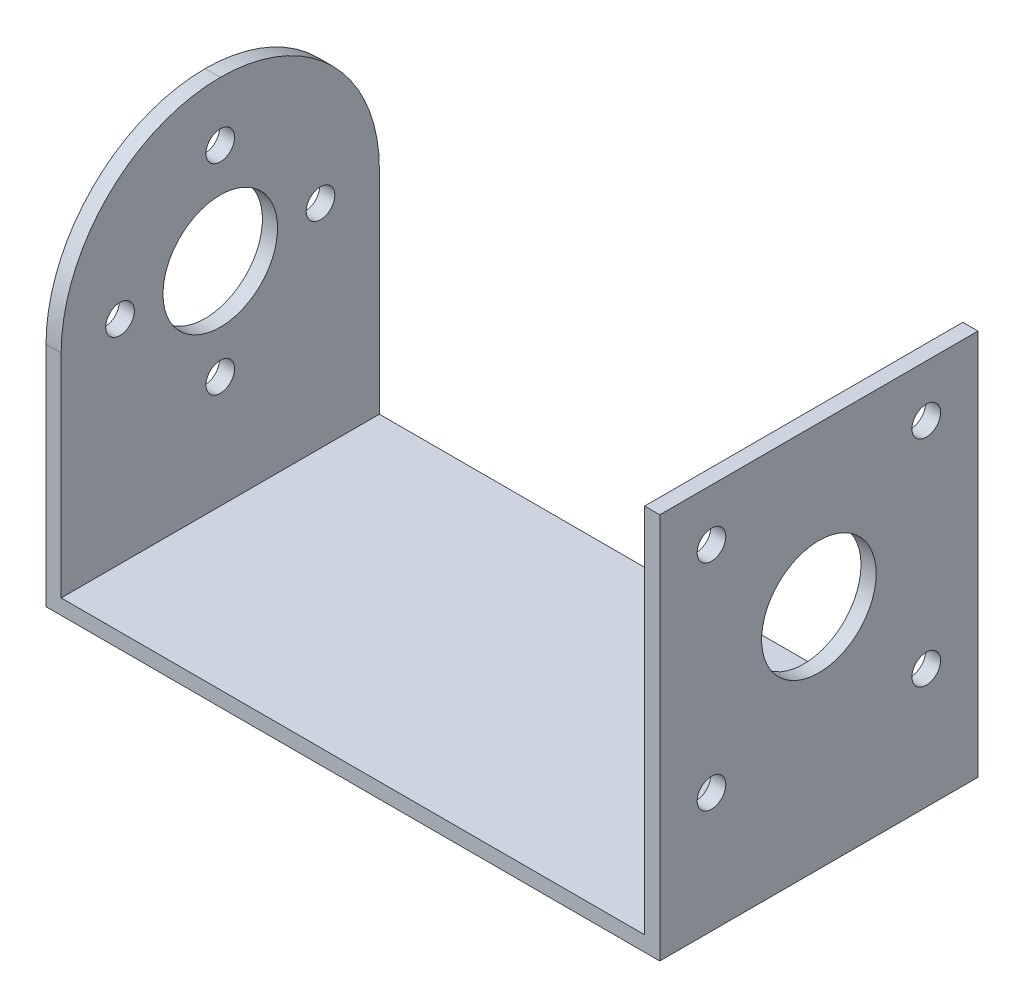
ISO-10303-21;
HEADER;
FILE_DESCRIPTION(('STEP AP214'),'2;1');
FILE_NAME('part.step','',(''),(''),'','','');
FILE_SCHEMA(('AUTOMOTIVE_DESIGN { 1 0 10303 214 1 1 1 1 }'));
ENDSEC;
DATA;
#1=APPLICATION_CONTEXT('core data for automotive mechanical design processes');
#2=APPLICATION_PROTOCOL_DEFINITION('international standard','automotive_design',2000,#1);
#3=PRODUCT_CONTEXT('',#1,'mechanical');
#4=PRODUCT('Part','Part','',(#3));
#5=PRODUCT_RELATED_PRODUCT_CATEGORY('part','',(#4));
#6=PRODUCT_DEFINITION_FORMATION('','',#4);
#7=PRODUCT_DEFINITION_CONTEXT('part definition',#1,'design');
#8=PRODUCT_DEFINITION('design','',#6,#7);
#9=PRODUCT_DEFINITION_SHAPE('','',#8);
#10=(LENGTH_UNIT() NAMED_UNIT(*) SI_UNIT(.MILLI.,.METRE.));
#11=(NAMED_UNIT(*) PLANE_ANGLE_UNIT() SI_UNIT($,.RADIAN.));
#12=(NAMED_UNIT(*) SI_UNIT($,.STERADIAN.) SOLID_ANGLE_UNIT());
#13=UNCERTAINTY_MEASURE_WITH_UNIT(LENGTH_MEASURE(1.E-05),#10,'distance_accuracy_value','');
#14=(GEOMETRIC_REPRESENTATION_CONTEXT(3) GLOBAL_UNCERTAINTY_ASSIGNED_CONTEXT((#13)) GLOBAL_UNIT_ASSIGNED_CONTEXT((#10,
#11,#12)) REPRESENTATION_CONTEXT('',''));
#15=CARTESIAN_POINT('',(0.,0.,0.));
#16=DIRECTION('',(0.,0.,1.));
#17=DIRECTION('',(1.,0.,0.));
#18=AXIS2_PLACEMENT_3D('',#15,#16,#17);
#19=CARTESIAN_POINT('',(0.,26.9875,22.225));
#20=DIRECTION('',(1.,0.,0.));
#21=DIRECTION('',(0.,0.,-1.));
#22=AXIS2_PLACEMENT_3D('',#19,#20,#21);
#23=PLANE('',#22);
#24=CARTESIAN_POINT('',(0.,15.8750000000001,18.1125));
#25=DIRECTION('',(-1.,0.,0.));
#26=DIRECTION('',(0.,-1.,0.));
#27=AXIS2_PLACEMENT_3D('',#24,#25,#26);
#28=CIRCLE('',#27,1.);
#29=CARTESIAN_POINT('',(0.,14.8750000000001,18.1125));
#30=VERTEX_POINT('',#29);
#31=EDGE_CURVE('E323',#30,#30,#28,.T.);
#32=ORIENTED_EDGE('',*,*,#31,.F.);
#33=EDGE_LOOP('',(#32));
#34=FACE_BOUND('',#33,.T.);
#35=CARTESIAN_POINT('',(0.,15.875,4.1125));
#36=DIRECTION('',(-1.,0.,0.));
#37=DIRECTION('',(0.,1.,0.));
#38=AXIS2_PLACEMENT_3D('',#35,#36,#37);
#39=CIRCLE('',#38,1.);
#40=CARTESIAN_POINT('',(0.,15.875,5.1125));
#41=VERTEX_POINT('',#40);
#42=EDGE_CURVE('E331',#41,#41,#39,.T.);
#43=ORIENTED_EDGE('',*,*,#42,.F.);
#44=EDGE_LOOP('',(#43));
#45=FACE_BOUND('',#44,.T.);
#46=CARTESIAN_POINT('',(0.,8.875,11.1125));
#47=DIRECTION('',(-1.,0.,0.));
#48=DIRECTION('',(0.,0.,-1.));
#49=AXIS2_PLACEMENT_3D('',#46,#47,#48);
#50=CIRCLE('',#49,1.);
#51=CARTESIAN_POINT('',(0.,8.875,10.1125));
#52=VERTEX_POINT('',#51);
#53=EDGE_CURVE('E324',#52,#52,#50,.T.);
#54=ORIENTED_EDGE('',*,*,#53,.F.);
#55=EDGE_LOOP('',(#54));
#56=FACE_BOUND('',#55,.T.);
#57=CARTESIAN_POINT('',(0.,15.875,11.1125));
#58=DIRECTION('',(-1.,0.,0.));
#59=DIRECTION('',(0.,0.,1.));
#60=AXIS2_PLACEMENT_3D('',#57,#58,#59);
#61=CIRCLE('',#60,4.);
#62=CARTESIAN_POINT('',(0.,15.875,15.1125));
#63=VERTEX_POINT('',#62);
#64=EDGE_CURVE('E200',#63,#63,#61,.T.);
#65=ORIENTED_EDGE('',*,*,#64,.F.);
#66=EDGE_LOOP('',(#65));
#67=FACE_BOUND('',#66,.T.);
#68=CARTESIAN_POINT('',(0.,22.875,11.1125));
#69=DIRECTION('',(-1.,0.,0.));
#70=DIRECTION('',(0.,0.,1.));
#71=AXIS2_PLACEMENT_3D('',#68,#69,#70);
#72=CIRCLE('',#71,1.);
#73=CARTESIAN_POINT('',(0.,22.875,12.1125));
#74=VERTEX_POINT('',#73);
#75=EDGE_CURVE('E209',#74,#74,#72,.T.);
#76=ORIENTED_EDGE('',*,*,#75,.F.);
#77=EDGE_LOOP('',(#76));
#78=FACE_BOUND('',#77,.T.);
#79=CARTESIAN_POINT('',(0.,15.875,11.1125));
#80=DIRECTION('',(1.,0.,0.));
#81=DIRECTION('',(0.,0.,-1.));
#82=AXIS2_PLACEMENT_3D('',#79,#80,#81);
#83=CIRCLE('',#82,11.1125);
#84=CARTESIAN_POINT('',(0.,15.875,22.225));
#85=VERTEX_POINT('',#84);
#86=CARTESIAN_POINT('',(0.,26.9875,11.1125));
#87=VERTEX_POINT('',#86);
#88=EDGE_CURVE('E117',#85,#87,#83,.F.);
#89=ORIENTED_EDGE('',*,*,#88,.T.);
#90=CARTESIAN_POINT('',(0.,15.875,11.1125));
#91=DIRECTION('',(1.,0.,0.));
#92=DIRECTION('',(0.,0.,-1.));
#93=AXIS2_PLACEMENT_3D('',#90,#91,#92);
#94=CIRCLE('',#93,11.1125);
#95=CARTESIAN_POINT('',(0.,15.875,0.));
#96=VERTEX_POINT('',#95);
#97=EDGE_CURVE('E162',#87,#96,#94,.F.);
#98=ORIENTED_EDGE('',*,*,#97,.T.);
#99=DIRECTION('',(0.,-1.,0.));
#100=VECTOR('',#99,1.);
#101=CARTESIAN_POINT('',(0.,26.9875,0.));
#102=LINE('',#101,#100);
#103=CARTESIAN_POINT('',(0.,0.,0.));
#104=VERTEX_POINT('',#103);
#105=EDGE_CURVE('E114',#96,#104,#102,.T.);
#106=ORIENTED_EDGE('',*,*,#105,.T.);
#107=DIRECTION('',(0.,0.,-1.));
#108=VECTOR('',#107,1.);
#109=CARTESIAN_POINT('',(0.,0.,22.225));
#110=LINE('',#109,#108);
#111=CARTESIAN_POINT('',(0.,0.,22.225));
#112=VERTEX_POINT('',#111);
#113=EDGE_CURVE('E112',#112,#104,#110,.T.);
#114=ORIENTED_EDGE('',*,*,#113,.F.);
#115=DIRECTION('',(0.,-1.,0.));
#116=VECTOR('',#115,1.);
#117=CARTESIAN_POINT('',(0.,26.9875,22.225));
#118=LINE('',#117,#116);
#119=EDGE_CURVE('E100',#85,#112,#118,.T.);
#120=ORIENTED_EDGE('',*,*,#119,.F.);
#121=EDGE_LOOP('',(#89,#98,#106,#114,#120));
#122=FACE_BOUND('',#121,.T.);
#123=ADVANCED_FACE('F32',(#34,#45,#56,#67,#78,#122),#23,.F.);
#124=CARTESIAN_POINT('',(0.,0.,22.225));
#125=DIRECTION('',(0.,1.,0.));
#126=DIRECTION('',(0.,0.,1.));
#127=AXIS2_PLACEMENT_3D('',#124,#125,#126);
#128=PLANE('',#127);
#129=DIRECTION('',(1.,0.,0.));
#130=VECTOR('',#129,1.);
#131=CARTESIAN_POINT('',(0.,0.,0.));
#132=LINE('',#131,#130);
#133=CARTESIAN_POINT('',(42.8625,0.,0.));
#134=VERTEX_POINT('',#133);
#135=EDGE_CURVE('E138',#104,#134,#132,.T.);
#136=ORIENTED_EDGE('',*,*,#135,.T.);
#137=DIRECTION('',(0.,0.,-1.));
#138=VECTOR('',#137,1.);
#139=CARTESIAN_POINT('',(42.8625,0.,22.225));
#140=LINE('',#139,#138);
#141=CARTESIAN_POINT('',(42.8625,0.,22.225));
#142=VERTEX_POINT('',#141);
#143=EDGE_CURVE('E118',#142,#134,#140,.T.);
#144=ORIENTED_EDGE('',*,*,#143,.F.);
#145=DIRECTION('',(1.,0.,0.));
#146=VECTOR('',#145,1.);
#147=CARTESIAN_POINT('',(0.,0.,22.225));
#148=LINE('',#147,#146);
#149=EDGE_CURVE('E104',#112,#142,#148,.T.);
#150=ORIENTED_EDGE('',*,*,#149,.F.);
#151=ORIENTED_EDGE('',*,*,#113,.T.);
#152=EDGE_LOOP('',(#136,#144,#150,#151));
#153=FACE_BOUND('',#152,.T.);
#154=ADVANCED_FACE('F120',(#153),#128,.F.);
#155=CARTESIAN_POINT('',(42.8625,0.,22.225));
#156=DIRECTION('',(-1.,0.,0.));
#157=DIRECTION('',(0.,0.,1.));
#158=AXIS2_PLACEMENT_3D('',#155,#156,#157);
#159=PLANE('',#158);
#160=CARTESIAN_POINT('',(42.8625,23.3749999999999,18.6125));
#161=DIRECTION('',(1.,0.,0.));
#162=DIRECTION('',(0.,0.,-1.));
#163=AXIS2_PLACEMENT_3D('',#160,#161,#162);
#164=CIRCLE('',#163,1.);
#165=CARTESIAN_POINT('',(42.8625,23.3749999999999,17.6125));
#166=VERTEX_POINT('',#165);
#167=EDGE_CURVE('E306',#166,#166,#164,.T.);
#168=ORIENTED_EDGE('',*,*,#167,.F.);
#169=EDGE_LOOP('',(#168));
#170=FACE_BOUND('',#169,.T.);
#171=CARTESIAN_POINT('',(42.8625,8.37500000000008,3.6125));
#172=DIRECTION('',(1.,0.,0.));
#173=DIRECTION('',(0.,0.,-1.));
#174=AXIS2_PLACEMENT_3D('',#171,#172,#173);
#175=CIRCLE('',#174,1.);
#176=CARTESIAN_POINT('',(42.8625,8.37500000000008,2.6125));
#177=VERTEX_POINT('',#176);
#178=EDGE_CURVE('E298',#177,#177,#175,.T.);
#179=ORIENTED_EDGE('',*,*,#178,.F.);
#180=EDGE_LOOP('',(#179));
#181=FACE_BOUND('',#180,.T.);
#182=CARTESIAN_POINT('',(42.8625,8.37500000000008,18.6125));
#183=DIRECTION('',(1.,0.,0.));
#184=DIRECTION('',(0.,0.,-1.));
#185=AXIS2_PLACEMENT_3D('',#182,#183,#184);
#186=CIRCLE('',#185,1.);
#187=CARTESIAN_POINT('',(42.8625,8.37500000000008,17.6125));
#188=VERTEX_POINT('',#187);
#189=EDGE_CURVE('E294',#188,#188,#186,.T.);
#190=ORIENTED_EDGE('',*,*,#189,.F.);
#191=EDGE_LOOP('',(#190));
#192=FACE_BOUND('',#191,.T.);
#193=CARTESIAN_POINT('',(42.8625,15.875,11.1125));
#194=DIRECTION('',(1.,0.,0.));
#195=DIRECTION('',(0.,0.,-1.));
#196=AXIS2_PLACEMENT_3D('',#193,#194,#195);
#197=CIRCLE('',#196,4.);
#198=CARTESIAN_POINT('',(42.8625,15.875,7.1125));
#199=VERTEX_POINT('',#198);
#200=EDGE_CURVE('E301',#199,#199,#197,.T.);
#201=ORIENTED_EDGE('',*,*,#200,.F.);
#202=EDGE_LOOP('',(#201));
#203=FACE_BOUND('',#202,.T.);
#204=CARTESIAN_POINT('',(42.8625,23.3749999999999,3.6125));
#205=DIRECTION('',(1.,0.,0.));
#206=DIRECTION('',(0.,0.,-1.));
#207=AXIS2_PLACEMENT_3D('',#204,#205,#206);
#208=CIRCLE('',#207,1.);
#209=CARTESIAN_POINT('',(42.8625,23.3749999999999,2.6125));
#210=VERTEX_POINT('',#209);
#211=EDGE_CURVE('E313',#210,#210,#208,.T.);
#212=ORIENTED_EDGE('',*,*,#211,.F.);
#213=EDGE_LOOP('',(#212));
#214=FACE_BOUND('',#213,.T.);
#215=DIRECTION('',(0.,1.,0.));
#216=VECTOR('',#215,1.);
#217=CARTESIAN_POINT('',(42.8625,0.,0.));
#218=LINE('',#217,#216);
#219=CARTESIAN_POINT('',(42.8625,26.9875,0.));
#220=VERTEX_POINT('',#219);
#221=EDGE_CURVE('E140',#134,#220,#218,.T.);
#222=ORIENTED_EDGE('',*,*,#221,.T.);
#223=DIRECTION('',(0.,0.,-1.));
#224=VECTOR('',#223,1.);
#225=CARTESIAN_POINT('',(42.8625,26.9875,22.225));
#226=LINE('',#225,#224);
#227=CARTESIAN_POINT('',(42.8625,26.9875,22.225));
#228=VERTEX_POINT('',#227);
#229=EDGE_CURVE('E157',#228,#220,#226,.T.);
#230=ORIENTED_EDGE('',*,*,#229,.F.);
#231=DIRECTION('',(0.,1.,0.));
#232=VECTOR('',#231,1.);
#233=CARTESIAN_POINT('',(42.8625,0.,22.225));
#234=LINE('',#233,#232);
#235=EDGE_CURVE('E123',#142,#228,#234,.T.);
#236=ORIENTED_EDGE('',*,*,#235,.F.);
#237=ORIENTED_EDGE('',*,*,#143,.T.);
#238=EDGE_LOOP('',(#222,#230,#236,#237));
#239=FACE_BOUND('',#238,.T.);
#240=ADVANCED_FACE('F193',(#170,#181,#192,#203,#214,#239),#159,.F.);
#241=CARTESIAN_POINT('',(42.8625,26.9875,22.225));
#242=DIRECTION('',(0.,-1.,0.));
#243=DIRECTION('',(0.,0.,-1.));
#244=AXIS2_PLACEMENT_3D('',#241,#242,#243);
#245=PLANE('',#244);
#246=DIRECTION('',(-1.,0.,0.));
#247=VECTOR('',#246,1.);
#248=CARTESIAN_POINT('',(42.8625,26.9875,0.));
#249=LINE('',#248,#247);
#250=CARTESIAN_POINT('',(41.8041666666667,26.9875,0.));
#251=VERTEX_POINT('',#250);
#252=EDGE_CURVE('E142',#220,#251,#249,.T.);
#253=ORIENTED_EDGE('',*,*,#252,.T.);
#254=DIRECTION('',(0.,0.,-1.));
#255=VECTOR('',#254,1.);
#256=CARTESIAN_POINT('',(41.8041666666667,26.9875,22.225));
#257=LINE('',#256,#255);
#258=CARTESIAN_POINT('',(41.8041666666667,26.9875,22.225));
#259=VERTEX_POINT('',#258);
#260=EDGE_CURVE('E154',#259,#251,#257,.T.);
#261=ORIENTED_EDGE('',*,*,#260,.F.);
#262=DIRECTION('',(-1.,0.,0.));
#263=VECTOR('',#262,1.);
#264=CARTESIAN_POINT('',(42.8625,26.9875,22.225));
#265=LINE('',#264,#263);
#266=EDGE_CURVE('E125',#228,#259,#265,.T.);
#267=ORIENTED_EDGE('',*,*,#266,.F.);
#268=ORIENTED_EDGE('',*,*,#229,.T.);
#269=EDGE_LOOP('',(#253,#261,#267,#268));
#270=FACE_BOUND('',#269,.T.);
#271=ADVANCED_FACE('F190',(#270),#245,.F.);
#272=CARTESIAN_POINT('',(41.8041666666667,26.9875,22.225));
#273=DIRECTION('',(1.,0.,0.));
#274=DIRECTION('',(0.,1.,0.));
#275=AXIS2_PLACEMENT_3D('',#272,#273,#274);
#276=PLANE('',#275);
#277=CARTESIAN_POINT('',(41.8041666666667,23.3749999999999,18.6125));
#278=DIRECTION('',(1.,0.,0.));
#279=DIRECTION('',(0.,1.,0.));
#280=AXIS2_PLACEMENT_3D('',#277,#278,#279);
#281=CIRCLE('',#280,1.);
#282=CARTESIAN_POINT('',(41.8041666666667,24.3749999999999,18.6125));
#283=VERTEX_POINT('',#282);
#284=EDGE_CURVE('E309',#283,#283,#281,.F.);
#285=ORIENTED_EDGE('',*,*,#284,.F.);
#286=EDGE_LOOP('',(#285));
#287=FACE_BOUND('',#286,.T.);
#288=CARTESIAN_POINT('',(41.8041666666667,8.37500000000008,3.6125));
#289=DIRECTION('',(1.,0.,0.));
#290=DIRECTION('',(0.,1.,0.));
#291=AXIS2_PLACEMENT_3D('',#288,#289,#290);
#292=CIRCLE('',#291,1.);
#293=CARTESIAN_POINT('',(41.8041666666667,9.37500000000008,3.6125));
#294=VERTEX_POINT('',#293);
#295=EDGE_CURVE('E310',#294,#294,#292,.F.);
#296=ORIENTED_EDGE('',*,*,#295,.F.);
#297=EDGE_LOOP('',(#296));
#298=FACE_BOUND('',#297,.T.);
#299=CARTESIAN_POINT('',(41.8041666666667,8.37500000000008,18.6125));
#300=DIRECTION('',(1.,0.,0.));
#301=DIRECTION('',(0.,1.,0.));
#302=AXIS2_PLACEMENT_3D('',#299,#300,#301);
#303=CIRCLE('',#302,1.);
#304=CARTESIAN_POINT('',(41.8041666666667,9.37500000000009,18.6125));
#305=VERTEX_POINT('',#304);
#306=EDGE_CURVE('E291',#305,#305,#303,.F.);
#307=ORIENTED_EDGE('',*,*,#306,.F.);
#308=EDGE_LOOP('',(#307));
#309=FACE_BOUND('',#308,.T.);
#310=CARTESIAN_POINT('',(41.8041666666667,15.875,11.1125));
#311=DIRECTION('',(1.,0.,0.));
#312=DIRECTION('',(0.,1.,0.));
#313=AXIS2_PLACEMENT_3D('',#310,#311,#312);
#314=CIRCLE('',#313,4.);
#315=CARTESIAN_POINT('',(41.8041666666667,19.875,11.1125));
#316=VERTEX_POINT('',#315);
#317=EDGE_CURVE('E296',#316,#316,#314,.F.);
#318=ORIENTED_EDGE('',*,*,#317,.F.);
#319=EDGE_LOOP('',(#318));
#320=FACE_BOUND('',#319,.T.);
#321=CARTESIAN_POINT('',(41.8041666666667,23.3749999999999,3.6125));
#322=DIRECTION('',(1.,0.,0.));
#323=DIRECTION('',(0.,1.,0.));
#324=AXIS2_PLACEMENT_3D('',#321,#322,#323);
#325=CIRCLE('',#324,1.);
#326=CARTESIAN_POINT('',(41.8041666666667,24.3749999999999,3.6125));
#327=VERTEX_POINT('',#326);
#328=EDGE_CURVE('E320',#327,#327,#325,.F.);
#329=ORIENTED_EDGE('',*,*,#328,.F.);
#330=EDGE_LOOP('',(#329));
#331=FACE_BOUND('',#330,.T.);
#332=DIRECTION('',(0.,-1.,0.));
#333=VECTOR('',#332,1.);
#334=CARTESIAN_POINT('',(41.8041666666667,26.9875,0.));
#335=LINE('',#334,#333);
#336=CARTESIAN_POINT('',(41.8041666666667,1.05833333333333,0.));
#337=VERTEX_POINT('',#336);
#338=EDGE_CURVE('E144',#251,#337,#335,.T.);
#339=ORIENTED_EDGE('',*,*,#338,.T.);
#340=DIRECTION('',(0.,0.,-1.));
#341=VECTOR('',#340,1.);
#342=CARTESIAN_POINT('',(41.8041666666667,1.05833333333333,22.225));
#343=LINE('',#342,#341);
#344=CARTESIAN_POINT('',(41.8041666666667,1.05833333333333,22.225));
#345=VERTEX_POINT('',#344);
#346=EDGE_CURVE('E151',#345,#337,#343,.T.);
#347=ORIENTED_EDGE('',*,*,#346,.F.);
#348=DIRECTION('',(0.,-1.,0.));
#349=VECTOR('',#348,1.);
#350=CARTESIAN_POINT('',(41.8041666666667,26.9875,22.225));
#351=LINE('',#350,#349);
#352=EDGE_CURVE('E130',#259,#345,#351,.T.);
#353=ORIENTED_EDGE('',*,*,#352,.F.);
#354=ORIENTED_EDGE('',*,*,#260,.T.);
#355=EDGE_LOOP('',(#339,#347,#353,#354));
#356=FACE_BOUND('',#355,.T.);
#357=ADVANCED_FACE('F185',(#287,#298,#309,#320,#331,#356),#276,.F.);
#358=CARTESIAN_POINT('',(41.8041666666667,1.05833333333333,22.225));
#359=DIRECTION('',(0.,-1.,0.));
#360=DIRECTION('',(1.,0.,0.));
#361=AXIS2_PLACEMENT_3D('',#358,#359,#360);
#362=PLANE('',#361);
#363=DIRECTION('',(-1.,0.,0.));
#364=VECTOR('',#363,1.);
#365=CARTESIAN_POINT('',(41.8041666666667,1.05833333333333,0.));
#366=LINE('',#365,#364);
#367=CARTESIAN_POINT('',(1.05833333333333,1.05833333333333,0.));
#368=VERTEX_POINT('',#367);
#369=EDGE_CURVE('E146',#337,#368,#366,.T.);
#370=ORIENTED_EDGE('',*,*,#369,.T.);
#371=DIRECTION('',(0.,0.,-1.));
#372=VECTOR('',#371,1.);
#373=CARTESIAN_POINT('',(1.05833333333333,1.05833333333333,22.225));
#374=LINE('',#373,#372);
#375=CARTESIAN_POINT('',(1.05833333333333,1.05833333333333,22.225));
#376=VERTEX_POINT('',#375);
#377=EDGE_CURVE('E136',#376,#368,#374,.T.);
#378=ORIENTED_EDGE('',*,*,#377,.F.);
#379=DIRECTION('',(-1.,0.,0.));
#380=VECTOR('',#379,1.);
#381=CARTESIAN_POINT('',(41.8041666666667,1.05833333333333,22.225));
#382=LINE('',#381,#380);
#383=EDGE_CURVE('E132',#345,#376,#382,.T.);
#384=ORIENTED_EDGE('',*,*,#383,.F.);
#385=ORIENTED_EDGE('',*,*,#346,.T.);
#386=EDGE_LOOP('',(#370,#378,#384,#385));
#387=FACE_BOUND('',#386,.T.);
#388=ADVANCED_FACE('F179',(#387),#362,.F.);
#389=CARTESIAN_POINT('',(1.05833333333333,1.05833333333333,22.225));
#390=DIRECTION('',(-1.,0.,0.));
#391=DIRECTION('',(0.,0.,1.));
#392=AXIS2_PLACEMENT_3D('',#389,#390,#391);
#393=PLANE('',#392);
#394=CARTESIAN_POINT('',(1.05833333333333,15.8750000000001,18.1125));
#395=DIRECTION('',(-1.,0.,0.));
#396=DIRECTION('',(0.,0.,1.));
#397=AXIS2_PLACEMENT_3D('',#394,#395,#396);
#398=CIRCLE('',#397,1.);
#399=CARTESIAN_POINT('',(1.05833333333333,15.8750000000001,19.1125));
#400=VERTEX_POINT('',#399);
#401=EDGE_CURVE('E328',#400,#400,#398,.F.);
#402=ORIENTED_EDGE('',*,*,#401,.F.);
#403=EDGE_LOOP('',(#402));
#404=FACE_BOUND('',#403,.T.);
#405=CARTESIAN_POINT('',(1.05833333333333,15.875,4.1125));
#406=DIRECTION('',(-1.,0.,0.));
#407=DIRECTION('',(0.,0.,1.));
#408=AXIS2_PLACEMENT_3D('',#405,#406,#407);
#409=CIRCLE('',#408,1.);
#410=CARTESIAN_POINT('',(1.05833333333333,15.875,5.1125));
#411=VERTEX_POINT('',#410);
#412=EDGE_CURVE('E211',#411,#411,#409,.F.);
#413=ORIENTED_EDGE('',*,*,#412,.F.);
#414=EDGE_LOOP('',(#413));
#415=FACE_BOUND('',#414,.T.);
#416=CARTESIAN_POINT('',(1.05833333333333,8.875,11.1125));
#417=DIRECTION('',(-1.,0.,0.));
#418=DIRECTION('',(0.,0.,1.));
#419=AXIS2_PLACEMENT_3D('',#416,#417,#418);
#420=CIRCLE('',#419,1.);
#421=CARTESIAN_POINT('',(1.05833333333333,8.875,12.1125));
#422=VERTEX_POINT('',#421);
#423=EDGE_CURVE('E327',#422,#422,#420,.F.);
#424=ORIENTED_EDGE('',*,*,#423,.F.);
#425=EDGE_LOOP('',(#424));
#426=FACE_BOUND('',#425,.T.);
#427=CARTESIAN_POINT('',(1.05833333333333,15.875,11.1125));
#428=DIRECTION('',(-1.,0.,0.));
#429=DIRECTION('',(0.,0.,1.));
#430=AXIS2_PLACEMENT_3D('',#427,#428,#429);
#431=CIRCLE('',#430,4.);
#432=CARTESIAN_POINT('',(1.05833333333333,15.875,15.1125));
#433=VERTEX_POINT('',#432);
#434=EDGE_CURVE('E198',#433,#433,#431,.F.);
#435=ORIENTED_EDGE('',*,*,#434,.F.);
#436=EDGE_LOOP('',(#435));
#437=FACE_BOUND('',#436,.T.);
#438=CARTESIAN_POINT('',(1.05833333333333,22.875,11.1125));
#439=DIRECTION('',(-1.,0.,0.));
#440=DIRECTION('',(0.,0.,1.));
#441=AXIS2_PLACEMENT_3D('',#438,#439,#440);
#442=CIRCLE('',#441,1.);
#443=CARTESIAN_POINT('',(1.05833333333333,22.875,12.1125));
#444=VERTEX_POINT('',#443);
#445=EDGE_CURVE('E205',#444,#444,#442,.F.);
#446=ORIENTED_EDGE('',*,*,#445,.F.);
#447=EDGE_LOOP('',(#446));
#448=FACE_BOUND('',#447,.T.);
#449=DIRECTION('',(0.,1.,0.));
#450=VECTOR('',#449,1.);
#451=CARTESIAN_POINT('',(1.05833333333333,1.05833333333333,0.));
#452=LINE('',#451,#450);
#453=CARTESIAN_POINT('',(1.05833333333333,15.875,0.));
#454=VERTEX_POINT('',#453);
#455=EDGE_CURVE('E109',#368,#454,#452,.T.);
#456=ORIENTED_EDGE('',*,*,#455,.T.);
#457=CARTESIAN_POINT('',(1.05833333333333,15.875,11.1125));
#458=DIRECTION('',(-1.,0.,0.));
#459=DIRECTION('',(0.,0.,1.));
#460=AXIS2_PLACEMENT_3D('',#457,#458,#459);
#461=CIRCLE('',#460,11.1125);
#462=CARTESIAN_POINT('',(1.05833333333333,26.9875,11.1125));
#463=VERTEX_POINT('',#462);
#464=EDGE_CURVE('E41',#454,#463,#461,.F.);
#465=ORIENTED_EDGE('',*,*,#464,.T.);
#466=CARTESIAN_POINT('',(1.05833333333333,15.875,11.1125));
#467=DIRECTION('',(-1.,0.,0.));
#468=DIRECTION('',(0.,0.,1.));
#469=AXIS2_PLACEMENT_3D('',#466,#467,#468);
#470=CIRCLE('',#469,11.1125);
#471=CARTESIAN_POINT('',(1.05833333333333,15.875,22.225));
#472=VERTEX_POINT('',#471);
#473=EDGE_CURVE('E48',#463,#472,#470,.F.);
#474=ORIENTED_EDGE('',*,*,#473,.T.);
#475=DIRECTION('',(0.,1.,0.));
#476=VECTOR('',#475,1.);
#477=CARTESIAN_POINT('',(1.05833333333333,1.05833333333333,22.225));
#478=LINE('',#477,#476);
#479=EDGE_CURVE('E134',#376,#472,#478,.T.);
#480=ORIENTED_EDGE('',*,*,#479,.F.);
#481=ORIENTED_EDGE('',*,*,#377,.T.);
#482=EDGE_LOOP('',(#456,#465,#474,#480,#481));
#483=FACE_BOUND('',#482,.T.);
#484=ADVANCED_FACE('F175',(#404,#415,#426,#437,#448,#483),#393,.F.);
#485=CARTESIAN_POINT('',(0.,0.,22.225));
#486=DIRECTION('',(0.,0.,1.));
#487=DIRECTION('',(1.,0.,0.));
#488=AXIS2_PLACEMENT_3D('',#485,#486,#487);
#489=PLANE('',#488);
#490=ORIENTED_EDGE('',*,*,#479,.T.);
#491=DIRECTION('',(-1.,0.,0.));
#492=VECTOR('',#491,1.);
#493=CARTESIAN_POINT('',(0.,15.875,22.225));
#494=LINE('',#493,#492);
#495=EDGE_CURVE('E11',#472,#85,#494,.T.);
#496=ORIENTED_EDGE('',*,*,#495,.T.);
#497=ORIENTED_EDGE('',*,*,#119,.T.);
#498=ORIENTED_EDGE('',*,*,#149,.T.);
#499=ORIENTED_EDGE('',*,*,#235,.T.);
#500=ORIENTED_EDGE('',*,*,#266,.T.);
#501=ORIENTED_EDGE('',*,*,#352,.T.);
#502=ORIENTED_EDGE('',*,*,#383,.T.);
#503=EDGE_LOOP('',(#490,#496,#497,#498,#499,#500,#501,#502));
#504=FACE_BOUND('',#503,.T.);
#505=ADVANCED_FACE('F102',(#504),#489,.T.);
#506=CARTESIAN_POINT('',(0.,0.,0.));
#507=DIRECTION('',(0.,0.,1.));
#508=DIRECTION('',(1.,0.,0.));
#509=AXIS2_PLACEMENT_3D('',#506,#507,#508);
#510=PLANE('',#509);
#511=ORIENTED_EDGE('',*,*,#105,.F.);
#512=DIRECTION('',(-1.,0.,0.));
#513=VECTOR('',#512,1.);
#514=CARTESIAN_POINT('',(0.,15.875,0.));
#515=LINE('',#514,#513);
#516=EDGE_CURVE('E164',#96,#454,#515,.F.);
#517=ORIENTED_EDGE('',*,*,#516,.T.);
#518=ORIENTED_EDGE('',*,*,#455,.F.);
#519=ORIENTED_EDGE('',*,*,#369,.F.);
#520=ORIENTED_EDGE('',*,*,#338,.F.);
#521=ORIENTED_EDGE('',*,*,#252,.F.);
#522=ORIENTED_EDGE('',*,*,#221,.F.);
#523=ORIENTED_EDGE('',*,*,#135,.F.);
#524=EDGE_LOOP('',(#511,#517,#518,#519,#520,#521,#522,#523));
#525=FACE_BOUND('',#524,.T.);
#526=ADVANCED_FACE('F171',(#525),#510,.F.);
#527=CARTESIAN_POINT('',(0.,15.875,11.1125));
#528=DIRECTION('',(1.,0.,0.));
#529=DIRECTION('',(0.,0.,-1.));
#530=AXIS2_PLACEMENT_3D('',#527,#528,#529);
#531=CYLINDRICAL_SURFACE('',#530,11.1125);
#532=ORIENTED_EDGE('',*,*,#495,.F.);
#533=ORIENTED_EDGE('',*,*,#473,.F.);
#534=DIRECTION('',(-1.,0.,0.));
#535=VECTOR('',#534,1.);
#536=CARTESIAN_POINT('',(1.05833333333333,26.9875,11.1125));
#537=LINE('',#536,#535);
#538=EDGE_CURVE('E36',#87,#463,#537,.F.);
#539=ORIENTED_EDGE('',*,*,#538,.F.);
#540=ORIENTED_EDGE('',*,*,#88,.F.);
#541=EDGE_LOOP('',(#532,#533,#539,#540));
#542=FACE_BOUND('',#541,.T.);
#543=ADVANCED_FACE('F34',(#542),#531,.T.);
#544=CARTESIAN_POINT('',(1.05833333333333,15.875,11.1125));
#545=DIRECTION('',(-1.,0.,0.));
#546=DIRECTION('',(0.,0.,1.));
#547=AXIS2_PLACEMENT_3D('',#544,#545,#546);
#548=CYLINDRICAL_SURFACE('',#547,11.1125);
#549=ORIENTED_EDGE('',*,*,#464,.F.);
#550=ORIENTED_EDGE('',*,*,#516,.F.);
#551=ORIENTED_EDGE('',*,*,#97,.F.);
#552=ORIENTED_EDGE('',*,*,#538,.T.);
#553=EDGE_LOOP('',(#549,#550,#551,#552));
#554=FACE_BOUND('',#553,.T.);
#555=ADVANCED_FACE('F197',(#554),#548,.T.);
#556=CARTESIAN_POINT('',(12.3720418323181,22.875,11.1125));
#557=DIRECTION('',(-1.,0.,0.));
#558=DIRECTION('',(0.,0.,1.));
#559=AXIS2_PLACEMENT_3D('',#556,#557,#558);
#560=CYLINDRICAL_SURFACE('',#559,1.);
#561=ORIENTED_EDGE('',*,*,#445,.T.);
#562=EDGE_LOOP('',(#561));
#563=FACE_BOUND('',#562,.T.);
#564=ORIENTED_EDGE('',*,*,#75,.T.);
#565=EDGE_LOOP('',(#564));
#566=FACE_BOUND('',#565,.T.);
#567=ADVANCED_FACE('F215',(#563,#566),#560,.F.);
#568=CARTESIAN_POINT('',(12.3720418323181,15.875,11.1125));
#569=DIRECTION('',(-1.,0.,0.));
#570=DIRECTION('',(0.,0.,1.));
#571=AXIS2_PLACEMENT_3D('',#568,#569,#570);
#572=CYLINDRICAL_SURFACE('',#571,4.);
#573=ORIENTED_EDGE('',*,*,#434,.T.);
#574=EDGE_LOOP('',(#573));
#575=FACE_BOUND('',#574,.T.);
#576=ORIENTED_EDGE('',*,*,#64,.T.);
#577=EDGE_LOOP('',(#576));
#578=FACE_BOUND('',#577,.T.);
#579=ADVANCED_FACE('F245',(#575,#578),#572,.F.);
#580=CARTESIAN_POINT('',(12.3720418323181,8.875,11.1125));
#581=DIRECTION('',(-1.,0.,0.));
#582=DIRECTION('',(0.,0.,1.));
#583=AXIS2_PLACEMENT_3D('',#580,#581,#582);
#584=CYLINDRICAL_SURFACE('',#583,1.);
#585=ORIENTED_EDGE('',*,*,#423,.T.);
#586=EDGE_LOOP('',(#585));
#587=FACE_BOUND('',#586,.T.);
#588=ORIENTED_EDGE('',*,*,#53,.T.);
#589=EDGE_LOOP('',(#588));
#590=FACE_BOUND('',#589,.T.);
#591=ADVANCED_FACE('F255',(#587,#590),#584,.F.);
#592=CARTESIAN_POINT('',(12.3720418323181,15.875,4.1125));
#593=DIRECTION('',(-1.,0.,0.));
#594=DIRECTION('',(0.,0.,1.));
#595=AXIS2_PLACEMENT_3D('',#592,#593,#594);
#596=CYLINDRICAL_SURFACE('',#595,1.);
#597=CARTESIAN_POINT('',(1.05833333333333,15.875,5.1125));
#598=CARTESIAN_POINT('',(1.04730902777778,15.875,5.1125));
#599=CARTESIAN_POINT('',(1.03628472222222,15.875,5.1125));
#600=CARTESIAN_POINT('',(1.01423611111111,15.875,5.1125));
#601=CARTESIAN_POINT('',(1.00321180555556,15.875,5.1125));
#602=CARTESIAN_POINT('',(0.981163194444444,15.875,5.1125));
#603=CARTESIAN_POINT('',(0.970138888888889,15.875,5.1125));
#604=CARTESIAN_POINT('',(0.948090277777778,15.875,5.1125));
#605=CARTESIAN_POINT('',(0.937065972222223,15.875,5.1125));
#606=CARTESIAN_POINT('',(0.915017361111112,15.875,5.1125));
#607=CARTESIAN_POINT('',(0.903993055555556,15.875,5.1125));
#608=CARTESIAN_POINT('',(0.881944444444445,15.875,5.1125));
#609=CARTESIAN_POINT('',(0.87092013888889,15.875,5.1125));
#610=CARTESIAN_POINT('',(0.848871527777779,15.875,5.1125));
#611=CARTESIAN_POINT('',(0.837847222222223,15.875,5.1125));
#612=CARTESIAN_POINT('',(0.815798611111112,15.875,5.1125));
#613=CARTESIAN_POINT('',(0.804774305555557,15.875,5.1125));
#614=CARTESIAN_POINT('',(0.782725694444445,15.875,5.1125));
#615=CARTESIAN_POINT('',(0.771701388888889,15.875,5.1125));
#616=CARTESIAN_POINT('',(0.749652777777777,15.875,5.1125));
#617=CARTESIAN_POINT('',(0.738628472222222,15.875,5.1125));
#618=CARTESIAN_POINT('',(0.716579861111111,15.875,5.1125));
#619=CARTESIAN_POINT('',(0.705555555555555,15.875,5.1125));
#620=CARTESIAN_POINT('',(0.683506944444444,15.875,5.1125));
#621=CARTESIAN_POINT('',(0.672482638888889,15.875,5.1125));
#622=CARTESIAN_POINT('',(0.650434027777778,15.875,5.1125));
#623=CARTESIAN_POINT('',(0.639409722222222,15.875,5.1125));
#624=CARTESIAN_POINT('',(0.617361111111111,15.875,5.1125));
#625=CARTESIAN_POINT('',(0.606336805555556,15.875,5.1125));
#626=CARTESIAN_POINT('',(0.584288194444445,15.875,5.1125));
#627=CARTESIAN_POINT('',(0.573263888888889,15.875,5.1125));
#628=CARTESIAN_POINT('',(0.551215277777778,15.875,5.1125));
#629=CARTESIAN_POINT('',(0.540190972222223,15.875,5.1125));
#630=CARTESIAN_POINT('',(0.518142361111112,15.875,5.1125));
#631=CARTESIAN_POINT('',(0.507118055555556,15.875,5.1125));
#632=CARTESIAN_POINT('',(0.485069444444445,15.875,5.1125));
#633=CARTESIAN_POINT('',(0.47404513888889,15.875,5.1125));
#634=CARTESIAN_POINT('',(0.451996527777779,15.875,5.1125));
#635=CARTESIAN_POINT('',(0.440972222222223,15.875,5.1125));
#636=CARTESIAN_POINT('',(0.418923611111112,15.875,5.1125));
#637=CARTESIAN_POINT('',(0.407899305555557,15.875,5.1125));
#638=CARTESIAN_POINT('',(0.385850694444446,15.875,5.1125));
#639=CARTESIAN_POINT('',(0.37482638888889,15.875,5.1125));
#640=CARTESIAN_POINT('',(0.352777777777779,15.875,5.1125));
#641=CARTESIAN_POINT('',(0.341753472222224,15.875,5.1125));
#642=CARTESIAN_POINT('',(0.319704861111113,15.875,5.1125));
#643=CARTESIAN_POINT('',(0.308680555555557,15.875,5.1125));
#644=CARTESIAN_POINT('',(0.286631944444446,15.875,5.1125));
#645=CARTESIAN_POINT('',(0.27560763888889,15.875,5.1125));
#646=CARTESIAN_POINT('',(0.253559027777778,15.875,5.1125));
#647=CARTESIAN_POINT('',(0.242534722222223,15.875,5.1125));
#648=CARTESIAN_POINT('',(0.220486111111112,15.875,5.1125));
#649=CARTESIAN_POINT('',(0.209461805555556,15.875,5.1125));
#650=CARTESIAN_POINT('',(0.187413194444445,15.875,5.1125));
#651=CARTESIAN_POINT('',(0.17638888888889,15.875,5.1125));
#652=CARTESIAN_POINT('',(0.154340277777779,15.875,5.1125));
#653=CARTESIAN_POINT('',(0.143315972222223,15.875,5.1125));
#654=CARTESIAN_POINT('',(0.121267361111112,15.875,5.1125));
#655=CARTESIAN_POINT('',(0.110243055555557,15.875,5.1125));
#656=CARTESIAN_POINT('',(0.0881944444444457,15.875,5.1125));
#657=CARTESIAN_POINT('',(0.0771701388888902,15.875,5.1125));
#658=CARTESIAN_POINT('',(0.0551215277777792,15.875,5.1125));
#659=CARTESIAN_POINT('',(0.0440972222222237,15.875,5.1125));
#660=CARTESIAN_POINT('',(0.0220486111111127,15.875,5.1125));
#661=CARTESIAN_POINT('',(0.0110243055555572,15.875,5.1125));
#662=CARTESIAN_POINT('',(0.,15.875,5.1125));
#663=B_SPLINE_CURVE_WITH_KNOTS('',3,(#597,#598,#599,#600,#601,#602,#603,#604,#605,#606,#607,
#608,#609,#610,#611,#612,#613,#614,#615,#616,#617,#618,#619,#620,#621,#622,#623,#624,#625,#626,
#627,#628,#629,#630,#631,#632,#633,#634,#635,#636,#637,#638,#639,#640,#641,#642,#643,#644,#645,
#646,#647,#648,#649,#650,#651,#652,#653,#654,#655,#656,#657,#658,#659,#660,#661,#662),
.UNSPECIFIED.,.F.,.F.,(4,2,2,2,2,2,2,2,2,2,2,2,2,2,2,2,2,2,2,2,2,2,2,2,2,2,2,2,2,2,2,2,4),(0.,
0.0330729166666665,0.066145833333333,0.0992187499999995,0.132291666666666,0.165364583333332,
0.198437499999999,0.231510416666665,0.264583333333332,0.29765625,0.330729166666667,
0.363802083333333,0.396875,0.429947916666666,0.463020833333333,0.496093749999999,
0.529166666666666,0.562239583333332,0.595312499999999,0.628385416666665,0.661458333333332,
0.694531249999998,0.727604166666665,0.760677083333331,0.793749999999999,0.826822916666666,
0.859895833333332,0.892968749999999,0.926041666666665,0.959114583333332,0.992187499999998,
1.02526041666666,1.05833333333333),.UNSPECIFIED.);
#664=EDGE_CURVE('BSEAM260',#411,#41,#663,.T.);
#665=ORIENTED_EDGE('',*,*,#412,.T.);
#666=ORIENTED_EDGE('',*,*,#42,.T.);
#667=ORIENTED_EDGE('',*,*,#664,.T.);
#668=ORIENTED_EDGE('',*,*,#664,.F.);
#669=EDGE_LOOP('',(#665,#667,#666,#668));
#670=FACE_BOUND('',#669,.T.);
#671=ADVANCED_FACE('F260',(#670),#596,.F.);
#672=CARTESIAN_POINT('',(12.3720418323181,15.8750000000001,18.1125));
#673=DIRECTION('',(-1.,0.,0.));
#674=DIRECTION('',(0.,0.,1.));
#675=AXIS2_PLACEMENT_3D('',#672,#673,#674);
#676=CYLINDRICAL_SURFACE('',#675,1.);
#677=ORIENTED_EDGE('',*,*,#401,.T.);
#678=EDGE_LOOP('',(#677));
#679=FACE_BOUND('',#678,.T.);
#680=ORIENTED_EDGE('',*,*,#31,.T.);
#681=EDGE_LOOP('',(#680));
#682=FACE_BOUND('',#681,.T.);
#683=ADVANCED_FACE('F256',(#679,#682),#676,.F.);
#684=CARTESIAN_POINT('',(30.4904581676819,23.3749999999999,3.6125));
#685=DIRECTION('',(1.,0.,0.));
#686=DIRECTION('',(0.,0.,-1.));
#687=AXIS2_PLACEMENT_3D('',#684,#685,#686);
#688=CYLINDRICAL_SURFACE('',#687,1.);
#689=ORIENTED_EDGE('',*,*,#328,.T.);
#690=EDGE_LOOP('',(#689));
#691=FACE_BOUND('',#690,.T.);
#692=ORIENTED_EDGE('',*,*,#211,.T.);
#693=EDGE_LOOP('',(#692));
#694=FACE_BOUND('',#693,.T.);
#695=ADVANCED_FACE('F259',(#691,#694),#688,.F.);
#696=CARTESIAN_POINT('',(30.4904581676819,15.875,11.1125));
#697=DIRECTION('',(1.,0.,0.));
#698=DIRECTION('',(0.,0.,-1.));
#699=AXIS2_PLACEMENT_3D('',#696,#697,#698);
#700=CYLINDRICAL_SURFACE('',#699,4.);
#701=ORIENTED_EDGE('',*,*,#317,.T.);
#702=EDGE_LOOP('',(#701));
#703=FACE_BOUND('',#702,.T.);
#704=ORIENTED_EDGE('',*,*,#200,.T.);
#705=EDGE_LOOP('',(#704));
#706=FACE_BOUND('',#705,.T.);
#707=ADVANCED_FACE('F270',(#703,#706),#700,.F.);
#708=CARTESIAN_POINT('',(30.4904581676819,8.37500000000008,18.6125));
#709=DIRECTION('',(1.,0.,0.));
#710=DIRECTION('',(0.,0.,-1.));
#711=AXIS2_PLACEMENT_3D('',#708,#709,#710);
#712=CYLINDRICAL_SURFACE('',#711,1.);
#713=ORIENTED_EDGE('',*,*,#306,.T.);
#714=EDGE_LOOP('',(#713));
#715=FACE_BOUND('',#714,.T.);
#716=ORIENTED_EDGE('',*,*,#189,.T.);
#717=EDGE_LOOP('',(#716));
#718=FACE_BOUND('',#717,.T.);
#719=ADVANCED_FACE('F276',(#715,#718),#712,.F.);
#720=CARTESIAN_POINT('',(30.4904581676819,8.37500000000008,3.6125));
#721=DIRECTION('',(1.,0.,0.));
#722=DIRECTION('',(0.,0.,-1.));
#723=AXIS2_PLACEMENT_3D('',#720,#721,#722);
#724=CYLINDRICAL_SURFACE('',#723,1.);
#725=ORIENTED_EDGE('',*,*,#295,.T.);
#726=EDGE_LOOP('',(#725));
#727=FACE_BOUND('',#726,.T.);
#728=ORIENTED_EDGE('',*,*,#178,.T.);
#729=EDGE_LOOP('',(#728));
#730=FACE_BOUND('',#729,.T.);
#731=ADVANCED_FACE('F272',(#727,#730),#724,.F.);
#732=CARTESIAN_POINT('',(30.4904581676819,23.3749999999999,18.6125));
#733=DIRECTION('',(1.,0.,0.));
#734=DIRECTION('',(0.,0.,-1.));
#735=AXIS2_PLACEMENT_3D('',#732,#733,#734);
#736=CYLINDRICAL_SURFACE('',#735,1.);
#737=ORIENTED_EDGE('',*,*,#284,.T.);
#738=EDGE_LOOP('',(#737));
#739=FACE_BOUND('',#738,.T.);
#740=ORIENTED_EDGE('',*,*,#167,.T.);
#741=EDGE_LOOP('',(#740));
#742=FACE_BOUND('',#741,.T.);
#743=ADVANCED_FACE('F275',(#739,#742),#736,.F.);
#744=CLOSED_SHELL('',(#123,#154,#240,#271,#357,#388,#484,#505,#526,#543,#555,#567,#579,#591,
#671,#683,#695,#707,#719,#731,#743));
#745=MANIFOLD_SOLID_BREP('B2',#744);
#746=ADVANCED_BREP_SHAPE_REPRESENTATION('',(#18,#745),#14);
#747=SHAPE_DEFINITION_REPRESENTATION(#9,#746);
ENDSEC;
END-ISO-10303-21;
